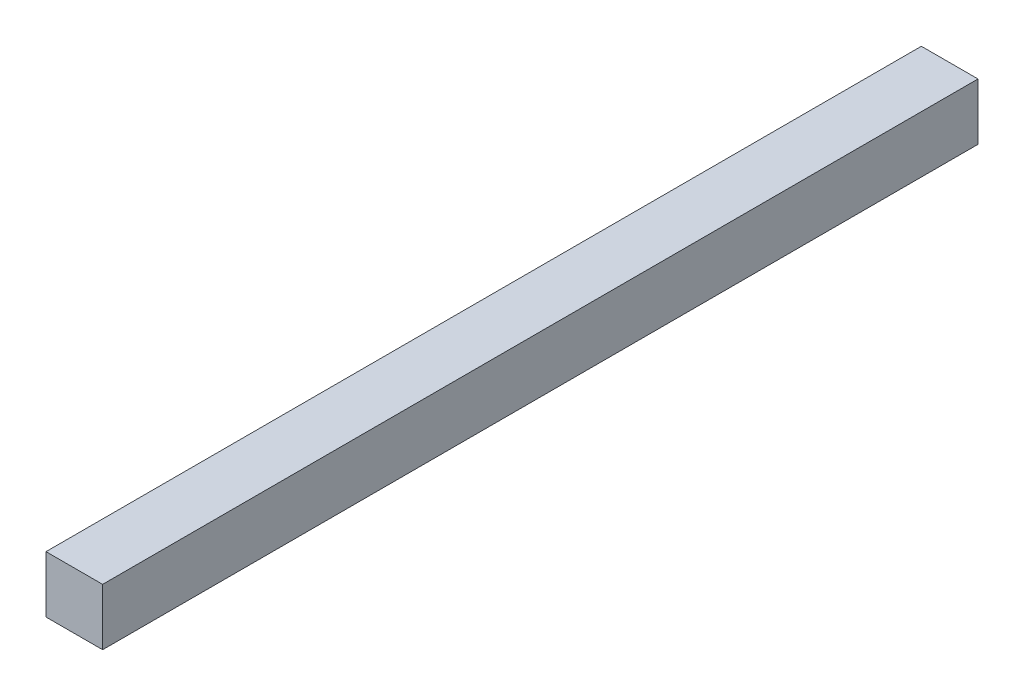
ISO-10303-21;
HEADER;
FILE_DESCRIPTION(('STEP AP214'),'2;1');
FILE_NAME('part.step','',(''),(''),'','','');
FILE_SCHEMA(('AUTOMOTIVE_DESIGN { 1 0 10303 214 1 1 1 1 }'));
ENDSEC;
DATA;
#1=APPLICATION_CONTEXT('core data for automotive mechanical design processes');
#2=APPLICATION_PROTOCOL_DEFINITION('international standard','automotive_design',2000,#1);
#3=PRODUCT_CONTEXT('',#1,'mechanical');
#4=PRODUCT('Part','Part','',(#3));
#5=PRODUCT_RELATED_PRODUCT_CATEGORY('part','',(#4));
#6=PRODUCT_DEFINITION_FORMATION('','',#4);
#7=PRODUCT_DEFINITION_CONTEXT('part definition',#1,'design');
#8=PRODUCT_DEFINITION('design','',#6,#7);
#9=PRODUCT_DEFINITION_SHAPE('','',#8);
#10=(LENGTH_UNIT() NAMED_UNIT(*) SI_UNIT(.MILLI.,.METRE.));
#11=(NAMED_UNIT(*) PLANE_ANGLE_UNIT() SI_UNIT($,.RADIAN.));
#12=(NAMED_UNIT(*) SI_UNIT($,.STERADIAN.) SOLID_ANGLE_UNIT());
#13=UNCERTAINTY_MEASURE_WITH_UNIT(LENGTH_MEASURE(1.E-05),#10,'distance_accuracy_value','');
#14=(GEOMETRIC_REPRESENTATION_CONTEXT(3) GLOBAL_UNCERTAINTY_ASSIGNED_CONTEXT((#13)) GLOBAL_UNIT_ASSIGNED_CONTEXT((#10,
#11,#12)) REPRESENTATION_CONTEXT('',''));
#15=CARTESIAN_POINT('',(0.,0.,0.));
#16=DIRECTION('',(0.,0.,1.));
#17=DIRECTION('',(1.,0.,0.));
#18=AXIS2_PLACEMENT_3D('',#15,#16,#17);
#19=CARTESIAN_POINT('',(-11.,11.,0.));
#20=DIRECTION('',(-1.,0.,0.));
#21=DIRECTION('',(0.,0.,1.));
#22=AXIS2_PLACEMENT_3D('',#19,#20,#21);
#23=PLANE('',#22);
#24=DIRECTION('',(0.,1.,0.));
#25=VECTOR('',#24,1.);
#26=CARTESIAN_POINT('',(-11.,0.,340.));
#27=LINE('',#26,#25);
#28=CARTESIAN_POINT('',(-11.,11.,340.));
#29=VERTEX_POINT('',#28);
#30=CARTESIAN_POINT('',(-11.,-11.,340.));
#31=VERTEX_POINT('',#30);
#32=EDGE_CURVE('E68',#29,#31,#27,.F.);
#33=ORIENTED_EDGE('',*,*,#32,.F.);
#34=DIRECTION('',(0.,0.,1.));
#35=VECTOR('',#34,1.);
#36=CARTESIAN_POINT('',(-11.,11.,0.));
#37=LINE('',#36,#35);
#38=CARTESIAN_POINT('',(-11.,11.,0.));
#39=VERTEX_POINT('',#38);
#40=EDGE_CURVE('E55',#39,#29,#37,.T.);
#41=ORIENTED_EDGE('',*,*,#40,.F.);
#42=DIRECTION('',(0.,1.,0.));
#43=VECTOR('',#42,1.);
#44=CARTESIAN_POINT('',(-11.,0.,0.));
#45=LINE('',#44,#43);
#46=CARTESIAN_POINT('',(-11.,-11.,0.));
#47=VERTEX_POINT('',#46);
#48=EDGE_CURVE('E20',#39,#47,#45,.F.);
#49=ORIENTED_EDGE('',*,*,#48,.T.);
#50=DIRECTION('',(0.,0.,-1.));
#51=VECTOR('',#50,1.);
#52=CARTESIAN_POINT('',(-11.,-11.,0.));
#53=LINE('',#52,#51);
#54=EDGE_CURVE('E81',#31,#47,#53,.T.);
#55=ORIENTED_EDGE('',*,*,#54,.F.);
#56=EDGE_LOOP('',(#33,#41,#49,#55));
#57=FACE_BOUND('',#56,.T.);
#58=ADVANCED_FACE('F17',(#57),#23,.T.);
#59=CARTESIAN_POINT('',(0.,0.,0.));
#60=DIRECTION('',(0.,0.,1.));
#61=DIRECTION('',(1.,0.,0.));
#62=AXIS2_PLACEMENT_3D('',#59,#60,#61);
#63=PLANE('',#62);
#64=DIRECTION('',(0.,1.,0.));
#65=VECTOR('',#64,1.);
#66=CARTESIAN_POINT('',(11.,-11.,0.));
#67=LINE('',#66,#65);
#68=CARTESIAN_POINT('',(11.,-11.,0.));
#69=VERTEX_POINT('',#68);
#70=CARTESIAN_POINT('',(11.,11.,0.));
#71=VERTEX_POINT('',#70);
#72=EDGE_CURVE('E83',#69,#71,#67,.T.);
#73=ORIENTED_EDGE('',*,*,#72,.F.);
#74=DIRECTION('',(1.,0.,0.));
#75=VECTOR('',#74,1.);
#76=CARTESIAN_POINT('',(-11.,-11.,0.));
#77=LINE('',#76,#75);
#78=EDGE_CURVE('E64',#47,#69,#77,.T.);
#79=ORIENTED_EDGE('',*,*,#78,.F.);
#80=ORIENTED_EDGE('',*,*,#48,.F.);
#81=DIRECTION('',(1.,0.,0.));
#82=VECTOR('',#81,1.);
#83=CARTESIAN_POINT('',(11.,11.,0.));
#84=LINE('',#83,#82);
#85=EDGE_CURVE('E61',#71,#39,#84,.F.);
#86=ORIENTED_EDGE('',*,*,#85,.F.);
#87=EDGE_LOOP('',(#73,#79,#80,#86));
#88=FACE_BOUND('',#87,.T.);
#89=ADVANCED_FACE('F60',(#88),#63,.F.);
#90=CARTESIAN_POINT('',(11.,11.,0.));
#91=DIRECTION('',(0.,1.,0.));
#92=DIRECTION('',(0.,0.,1.));
#93=AXIS2_PLACEMENT_3D('',#90,#91,#92);
#94=PLANE('',#93);
#95=DIRECTION('',(1.,0.,0.));
#96=VECTOR('',#95,1.);
#97=CARTESIAN_POINT('',(0.,11.,340.));
#98=LINE('',#97,#96);
#99=CARTESIAN_POINT('',(11.,11.,340.));
#100=VERTEX_POINT('',#99);
#101=EDGE_CURVE('E70',#100,#29,#98,.F.);
#102=ORIENTED_EDGE('',*,*,#101,.F.);
#103=DIRECTION('',(0.,0.,1.));
#104=VECTOR('',#103,1.);
#105=CARTESIAN_POINT('',(11.,11.,0.));
#106=LINE('',#105,#104);
#107=EDGE_CURVE('E74',#71,#100,#106,.T.);
#108=ORIENTED_EDGE('',*,*,#107,.F.);
#109=ORIENTED_EDGE('',*,*,#85,.T.);
#110=ORIENTED_EDGE('',*,*,#40,.T.);
#111=EDGE_LOOP('',(#102,#108,#109,#110));
#112=FACE_BOUND('',#111,.T.);
#113=ADVANCED_FACE('F72',(#112),#94,.T.);
#114=CARTESIAN_POINT('',(0.,0.,340.));
#115=DIRECTION('',(0.,0.,1.));
#116=DIRECTION('',(1.,0.,0.));
#117=AXIS2_PLACEMENT_3D('',#114,#115,#116);
#118=PLANE('',#117);
#119=DIRECTION('',(1.,0.,0.));
#120=VECTOR('',#119,1.);
#121=CARTESIAN_POINT('',(-11.,-11.,340.));
#122=LINE('',#121,#120);
#123=CARTESIAN_POINT('',(11.,-11.,340.));
#124=VERTEX_POINT('',#123);
#125=EDGE_CURVE('E35',#124,#31,#122,.F.);
#126=ORIENTED_EDGE('',*,*,#125,.F.);
#127=DIRECTION('',(0.,1.,0.));
#128=VECTOR('',#127,1.);
#129=CARTESIAN_POINT('',(11.,-11.,340.));
#130=LINE('',#129,#128);
#131=EDGE_CURVE('E26',#100,#124,#130,.F.);
#132=ORIENTED_EDGE('',*,*,#131,.F.);
#133=ORIENTED_EDGE('',*,*,#101,.T.);
#134=ORIENTED_EDGE('',*,*,#32,.T.);
#135=EDGE_LOOP('',(#126,#132,#133,#134));
#136=FACE_BOUND('',#135,.T.);
#137=ADVANCED_FACE('F89',(#136),#118,.T.);
#138=CARTESIAN_POINT('',(-11.,-11.,0.));
#139=DIRECTION('',(0.,-1.,0.));
#140=DIRECTION('',(0.,0.,-1.));
#141=AXIS2_PLACEMENT_3D('',#138,#139,#140);
#142=PLANE('',#141);
#143=ORIENTED_EDGE('',*,*,#125,.T.);
#144=ORIENTED_EDGE('',*,*,#54,.T.);
#145=ORIENTED_EDGE('',*,*,#78,.T.);
#146=DIRECTION('',(0.,0.,1.));
#147=VECTOR('',#146,1.);
#148=CARTESIAN_POINT('',(11.,-11.,0.));
#149=LINE('',#148,#147);
#150=EDGE_CURVE('E11',#124,#69,#149,.F.);
#151=ORIENTED_EDGE('',*,*,#150,.F.);
#152=EDGE_LOOP('',(#143,#144,#145,#151));
#153=FACE_BOUND('',#152,.T.);
#154=ADVANCED_FACE('F91',(#153),#142,.T.);
#155=CARTESIAN_POINT('',(11.,-11.,0.));
#156=DIRECTION('',(1.,0.,0.));
#157=DIRECTION('',(0.,1.,0.));
#158=AXIS2_PLACEMENT_3D('',#155,#156,#157);
#159=PLANE('',#158);
#160=ORIENTED_EDGE('',*,*,#131,.T.);
#161=ORIENTED_EDGE('',*,*,#150,.T.);
#162=ORIENTED_EDGE('',*,*,#72,.T.);
#163=ORIENTED_EDGE('',*,*,#107,.T.);
#164=EDGE_LOOP('',(#160,#161,#162,#163));
#165=FACE_BOUND('',#164,.T.);
#166=ADVANCED_FACE('F88',(#165),#159,.T.);
#167=CLOSED_SHELL('',(#58,#89,#113,#137,#154,#166));
#168=MANIFOLD_SOLID_BREP('B1',#167);
#169=ADVANCED_BREP_SHAPE_REPRESENTATION('',(#18,#168),#14);
#170=SHAPE_DEFINITION_REPRESENTATION(#9,#169);
ENDSEC;
END-ISO-10303-21;
